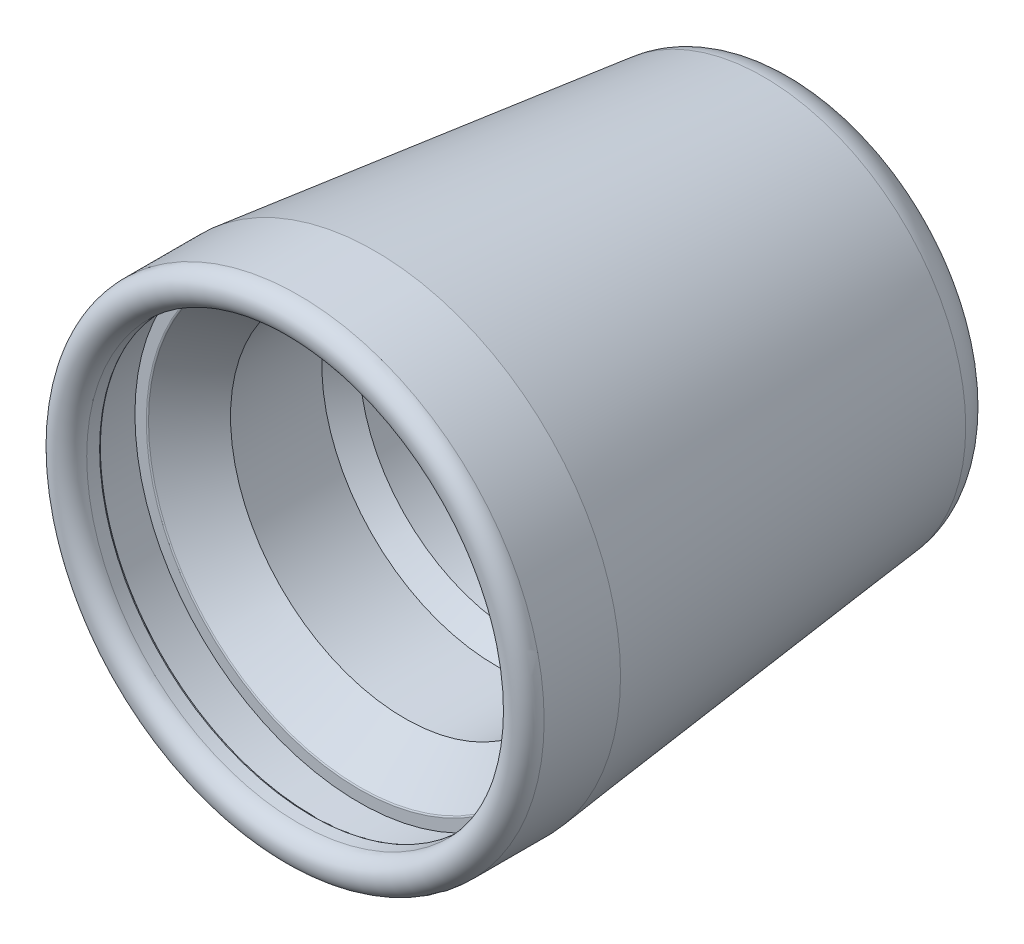
ISO-10303-21;
HEADER;
FILE_DESCRIPTION(('STEP AP214'),'2;1');
FILE_NAME('part.step','',(''),(''),'','','');
FILE_SCHEMA(('AUTOMOTIVE_DESIGN { 1 0 10303 214 1 1 1 1 }'));
ENDSEC;
DATA;
#1=APPLICATION_CONTEXT('core data for automotive mechanical design processes');
#2=APPLICATION_PROTOCOL_DEFINITION('international standard','automotive_design',2000,#1);
#3=PRODUCT_CONTEXT('',#1,'mechanical');
#4=PRODUCT('Part','Part','',(#3));
#5=PRODUCT_RELATED_PRODUCT_CATEGORY('part','',(#4));
#6=PRODUCT_DEFINITION_FORMATION('','',#4);
#7=PRODUCT_DEFINITION_CONTEXT('part definition',#1,'design');
#8=PRODUCT_DEFINITION('design','',#6,#7);
#9=PRODUCT_DEFINITION_SHAPE('','',#8);
#10=(LENGTH_UNIT() NAMED_UNIT(*) SI_UNIT(.MILLI.,.METRE.));
#11=(NAMED_UNIT(*) PLANE_ANGLE_UNIT() SI_UNIT($,.RADIAN.));
#12=(NAMED_UNIT(*) SI_UNIT($,.STERADIAN.) SOLID_ANGLE_UNIT());
#13=UNCERTAINTY_MEASURE_WITH_UNIT(LENGTH_MEASURE(1.E-05),#10,'distance_accuracy_value','');
#14=(GEOMETRIC_REPRESENTATION_CONTEXT(3) GLOBAL_UNCERTAINTY_ASSIGNED_CONTEXT((#13)) GLOBAL_UNIT_ASSIGNED_CONTEXT((#10,
#11,#12)) REPRESENTATION_CONTEXT('',''));
#15=CARTESIAN_POINT('',(0.,0.,0.));
#16=DIRECTION('',(0.,0.,1.));
#17=DIRECTION('',(1.,0.,0.));
#18=AXIS2_PLACEMENT_3D('',#15,#16,#17);
#19=CARTESIAN_POINT('',(0.,0.,3.937));
#20=DIRECTION('',(0.,0.,1.));
#21=DIRECTION('',(1.,0.,0.));
#22=AXIS2_PLACEMENT_3D('',#19,#20,#21);
#23=CYLINDRICAL_SURFACE('',#22,13.5636);
#24=CARTESIAN_POINT('',(0.,0.,4.064));
#25=DIRECTION('',(0.,0.,1.));
#26=DIRECTION('',(1.,0.,0.));
#27=AXIS2_PLACEMENT_3D('',#24,#25,#26);
#28=CIRCLE('',#27,13.5636);
#29=CARTESIAN_POINT('',(13.5636,0.,4.064));
#30=VERTEX_POINT('',#29);
#31=EDGE_CURVE('E62',#30,#30,#28,.F.);
#32=ORIENTED_EDGE('',*,*,#31,.T.);
#33=EDGE_LOOP('',(#32));
#34=FACE_BOUND('',#33,.T.);
#35=CARTESIAN_POINT('',(0.,0.,4.8895));
#36=DIRECTION('',(0.,0.,-1.));
#37=DIRECTION('',(-1.,0.,0.));
#38=AXIS2_PLACEMENT_3D('',#35,#36,#37);
#39=CIRCLE('',#38,13.5636);
#40=CARTESIAN_POINT('',(-13.5636,0.,4.8895));
#41=VERTEX_POINT('',#40);
#42=EDGE_CURVE('E86',#41,#41,#39,.T.);
#43=ORIENTED_EDGE('',*,*,#42,.F.);
#44=EDGE_LOOP('',(#43));
#45=FACE_BOUND('',#44,.T.);
#46=ADVANCED_FACE('F27',(#34,#45),#23,.F.);
#47=CARTESIAN_POINT('',(0.,0.,-27.051));
#48=DIRECTION('',(0.,0.,1.));
#49=DIRECTION('',(1.,0.,0.));
#50=AXIS2_PLACEMENT_3D('',#47,#48,#49);
#51=CYLINDRICAL_SURFACE('',#50,10.1346);
#52=CARTESIAN_POINT('',(0.,0.,-14.478));
#53=DIRECTION('',(0.,0.,-1.));
#54=DIRECTION('',(-1.,0.,0.));
#55=AXIS2_PLACEMENT_3D('',#52,#53,#54);
#56=CIRCLE('',#55,10.1346);
#57=CARTESIAN_POINT('',(-10.1346,0.,-14.478));
#58=VERTEX_POINT('',#57);
#59=EDGE_CURVE('E42',#58,#58,#56,.T.);
#60=ORIENTED_EDGE('',*,*,#59,.T.);
#61=EDGE_LOOP('',(#60));
#62=FACE_BOUND('',#61,.T.);
#63=CARTESIAN_POINT('',(0.,0.,-9.144));
#64=DIRECTION('',(0.,0.,1.));
#65=DIRECTION('',(1.,0.,0.));
#66=AXIS2_PLACEMENT_3D('',#63,#64,#65);
#67=CIRCLE('',#66,10.1346);
#68=CARTESIAN_POINT('',(10.1346,0.,-9.144));
#69=VERTEX_POINT('',#68);
#70=EDGE_CURVE('E83',#69,#69,#67,.T.);
#71=ORIENTED_EDGE('',*,*,#70,.T.);
#72=EDGE_LOOP('',(#71));
#73=FACE_BOUND('',#72,.T.);
#74=ADVANCED_FACE('F104',(#62,#73),#51,.F.);
#75=CARTESIAN_POINT('',(0.,0.,1.016));
#76=DIRECTION('',(0.,0.,1.));
#77=DIRECTION('',(1.,0.,0.));
#78=AXIS2_PLACEMENT_3D('',#75,#76,#77);
#79=PLANE('',#78);
#80=CARTESIAN_POINT('',(0.,0.,1.016));
#81=DIRECTION('',(0.,0.,1.));
#82=DIRECTION('',(1.,0.,0.));
#83=AXIS2_PLACEMENT_3D('',#80,#81,#82);
#84=CIRCLE('',#83,13.6234162699176);
#85=CARTESIAN_POINT('',(13.6234162699176,0.,1.016));
#86=VERTEX_POINT('',#85);
#87=EDGE_CURVE('E53',#86,#86,#84,.F.);
#88=ORIENTED_EDGE('',*,*,#87,.T.);
#89=EDGE_LOOP('',(#88));
#90=FACE_BOUND('',#89,.T.);
#91=CARTESIAN_POINT('',(0.,0.,1.016));
#92=DIRECTION('',(0.,0.,1.));
#93=DIRECTION('',(1.,0.,0.));
#94=AXIS2_PLACEMENT_3D('',#91,#92,#93);
#95=CIRCLE('',#94,14.351);
#96=CARTESIAN_POINT('',(14.351,0.,1.016));
#97=VERTEX_POINT('',#96);
#98=EDGE_CURVE('E71',#97,#97,#95,.T.);
#99=ORIENTED_EDGE('',*,*,#98,.T.);
#100=EDGE_LOOP('',(#99));
#101=FACE_BOUND('',#100,.T.);
#102=ADVANCED_FACE('F110',(#90,#101),#79,.T.);
#103=CARTESIAN_POINT('',(0.,0.,5.969));
#104=DIRECTION('',(0.,0.,-1.));
#105=DIRECTION('',(-1.,0.,0.));
#106=AXIS2_PLACEMENT_3D('',#103,#104,#105);
#107=CYLINDRICAL_SURFACE('',#106,15.7226);
#108=CARTESIAN_POINT('',(0.,0.,4.8895));
#109=DIRECTION('',(0.,0.,-1.));
#110=DIRECTION('',(-1.,0.,0.));
#111=AXIS2_PLACEMENT_3D('',#108,#109,#110);
#112=CIRCLE('',#111,15.7226);
#113=CARTESIAN_POINT('',(-15.7226,0.,4.8895));
#114=VERTEX_POINT('',#113);
#115=EDGE_CURVE('E89',#114,#114,#112,.T.);
#116=ORIENTED_EDGE('',*,*,#115,.T.);
#117=EDGE_LOOP('',(#116));
#118=FACE_BOUND('',#117,.T.);
#119=CARTESIAN_POINT('',(0.,0.,0.));
#120=DIRECTION('',(0.,0.,-1.));
#121=DIRECTION('',(-1.,0.,0.));
#122=AXIS2_PLACEMENT_3D('',#119,#120,#121);
#123=CIRCLE('',#122,15.7226);
#124=CARTESIAN_POINT('',(-15.7226,0.,0.));
#125=VERTEX_POINT('',#124);
#126=EDGE_CURVE('E68',#125,#125,#123,.T.);
#127=ORIENTED_EDGE('',*,*,#126,.F.);
#128=EDGE_LOOP('',(#127));
#129=FACE_BOUND('',#128,.T.);
#130=ADVANCED_FACE('F29',(#118,#129),#107,.T.);
#131=CARTESIAN_POINT('',(0.,0.,-27.051));
#132=DIRECTION('',(0.,0.,1.));
#133=DIRECTION('',(1.,0.,0.));
#134=AXIS2_PLACEMENT_3D('',#131,#132,#133);
#135=CONICAL_SURFACE('',#134,12.7,0.111275522826349);
#136=CARTESIAN_POINT('',(0.,0.,-24.8792369988799));
#137=DIRECTION('',(0.,0.,1.));
#138=DIRECTION('',(1.,0.,0.));
#139=AXIS2_PLACEMENT_3D('',#136,#137,#138);
#140=CIRCLE('',#139,12.9426664761815);
#141=CARTESIAN_POINT('',(12.9426664761815,0.,-24.8792369988799));
#142=VERTEX_POINT('',#141);
#143=EDGE_CURVE('E65',#142,#142,#140,.T.);
#144=ORIENTED_EDGE('',*,*,#143,.T.);
#145=EDGE_LOOP('',(#144));
#146=FACE_BOUND('',#145,.T.);
#147=ORIENTED_EDGE('',*,*,#126,.T.);
#148=EDGE_LOOP('',(#147));
#149=FACE_BOUND('',#148,.T.);
#150=ADVANCED_FACE('F116',(#146,#149),#135,.T.);
#151=CARTESIAN_POINT('',(0.,0.,3.937));
#152=DIRECTION('',(0.,0.,1.));
#153=DIRECTION('',(1.,0.,0.));
#154=AXIS2_PLACEMENT_3D('',#151,#152,#153);
#155=PLANE('',#154);
#156=CARTESIAN_POINT('',(0.,0.,3.937));
#157=DIRECTION('',(0.,0.,1.));
#158=DIRECTION('',(1.,0.,0.));
#159=AXIS2_PLACEMENT_3D('',#156,#157,#158);
#160=CIRCLE('',#159,13.6906);
#161=CARTESIAN_POINT('',(13.6906,0.,3.937));
#162=VERTEX_POINT('',#161);
#163=EDGE_CURVE('E59',#162,#162,#160,.T.);
#164=ORIENTED_EDGE('',*,*,#163,.T.);
#165=EDGE_LOOP('',(#164));
#166=FACE_BOUND('',#165,.T.);
#167=CARTESIAN_POINT('',(0.,0.,3.937));
#168=DIRECTION('',(0.,0.,1.));
#169=DIRECTION('',(1.,0.,0.));
#170=AXIS2_PLACEMENT_3D('',#167,#168,#169);
#171=CIRCLE('',#170,14.351);
#172=CARTESIAN_POINT('',(14.351,0.,3.937));
#173=VERTEX_POINT('',#172);
#174=EDGE_CURVE('E74',#173,#173,#171,.T.);
#175=ORIENTED_EDGE('',*,*,#174,.F.);
#176=EDGE_LOOP('',(#175));
#177=FACE_BOUND('',#176,.T.);
#178=ADVANCED_FACE('F118',(#166,#177),#155,.F.);
#179=CARTESIAN_POINT('',(0.,0.,1.016));
#180=DIRECTION('',(0.,0.,1.));
#181=DIRECTION('',(1.,0.,0.));
#182=AXIS2_PLACEMENT_3D('',#179,#180,#181);
#183=CYLINDRICAL_SURFACE('',#182,14.351);
#184=ORIENTED_EDGE('',*,*,#98,.F.);
#185=EDGE_LOOP('',(#184));
#186=FACE_BOUND('',#185,.T.);
#187=ORIENTED_EDGE('',*,*,#174,.T.);
#188=EDGE_LOOP('',(#187));
#189=FACE_BOUND('',#188,.T.);
#190=ADVANCED_FACE('F114',(#186,#189),#183,.F.);
#191=CARTESIAN_POINT('',(0.,0.,-1.905));
#192=DIRECTION('',(0.,0.,1.));
#193=DIRECTION('',(1.,0.,0.));
#194=AXIS2_PLACEMENT_3D('',#191,#192,#193);
#195=CONICAL_SURFACE('',#194,11.1506,0.690446457054692);
#196=CARTESIAN_POINT('',(0.,0.,0.969883943768525));
#197=DIRECTION('',(0.,0.,-1.));
#198=DIRECTION('',(-1.,0.,0.));
#199=AXIS2_PLACEMENT_3D('',#196,#197,#198);
#200=CIRCLE('',#199,13.525504127461);
#201=CARTESIAN_POINT('',(-13.525504127461,0.,0.969883943768525));
#202=VERTEX_POINT('',#201);
#203=EDGE_CURVE('E56',#202,#202,#200,.F.);
#204=ORIENTED_EDGE('',*,*,#203,.T.);
#205=EDGE_LOOP('',(#204));
#206=FACE_BOUND('',#205,.T.);
#207=CARTESIAN_POINT('',(0.,0.,-1.905));
#208=DIRECTION('',(0.,0.,1.));
#209=DIRECTION('',(1.,0.,0.));
#210=AXIS2_PLACEMENT_3D('',#207,#208,#209);
#211=CIRCLE('',#210,11.1506);
#212=CARTESIAN_POINT('',(11.1506,0.,-1.905));
#213=VERTEX_POINT('',#212);
#214=EDGE_CURVE('E77',#213,#213,#211,.T.);
#215=ORIENTED_EDGE('',*,*,#214,.F.);
#216=EDGE_LOOP('',(#215));
#217=FACE_BOUND('',#216,.T.);
#218=ADVANCED_FACE('F151',(#206,#217),#195,.F.);
#219=CARTESIAN_POINT('',(0.,0.,-7.747));
#220=DIRECTION('',(0.,0.,1.));
#221=DIRECTION('',(1.,0.,0.));
#222=AXIS2_PLACEMENT_3D('',#219,#220,#221);
#223=CYLINDRICAL_SURFACE('',#222,11.1506);
#224=CARTESIAN_POINT('',(0.,0.,-7.747));
#225=DIRECTION('',(0.,0.,1.));
#226=DIRECTION('',(1.,0.,0.));
#227=AXIS2_PLACEMENT_3D('',#224,#225,#226);
#228=CIRCLE('',#227,11.1506);
#229=CARTESIAN_POINT('',(11.1506,0.,-7.747));
#230=VERTEX_POINT('',#229);
#231=EDGE_CURVE('E80',#230,#230,#228,.T.);
#232=ORIENTED_EDGE('',*,*,#231,.F.);
#233=EDGE_LOOP('',(#232));
#234=FACE_BOUND('',#233,.T.);
#235=ORIENTED_EDGE('',*,*,#214,.T.);
#236=EDGE_LOOP('',(#235));
#237=FACE_BOUND('',#236,.T.);
#238=ADVANCED_FACE('F147',(#234,#237),#223,.F.);
#239=CARTESIAN_POINT('',(0.,0.,-9.144));
#240=DIRECTION('',(0.,0.,1.));
#241=DIRECTION('',(1.,0.,0.));
#242=AXIS2_PLACEMENT_3D('',#239,#240,#241);
#243=CONICAL_SURFACE('',#242,10.1346,0.628796286415433);
#244=ORIENTED_EDGE('',*,*,#231,.T.);
#245=EDGE_LOOP('',(#244));
#246=FACE_BOUND('',#245,.T.);
#247=ORIENTED_EDGE('',*,*,#70,.F.);
#248=EDGE_LOOP('',(#247));
#249=FACE_BOUND('',#248,.T.);
#250=ADVANCED_FACE('F143',(#246,#249),#243,.F.);
#251=CARTESIAN_POINT('',(0.,0.,-14.605));
#252=DIRECTION('',(0.,0.,-1.));
#253=DIRECTION('',(-1.,0.,0.));
#254=AXIS2_PLACEMENT_3D('',#251,#252,#253);
#255=PLANE('',#254);
#256=CARTESIAN_POINT('',(0.,0.,-14.605));
#257=DIRECTION('',(0.,0.,-1.));
#258=DIRECTION('',(-1.,0.,0.));
#259=AXIS2_PLACEMENT_3D('',#256,#257,#258);
#260=CIRCLE('',#259,10.2616);
#261=CARTESIAN_POINT('',(-10.2616,0.,-14.605));
#262=VERTEX_POINT('',#261);
#263=EDGE_CURVE('E47',#262,#262,#260,.F.);
#264=ORIENTED_EDGE('',*,*,#263,.T.);
#265=EDGE_LOOP('',(#264));
#266=FACE_BOUND('',#265,.T.);
#267=CARTESIAN_POINT('',(0.,0.,-14.605));
#268=DIRECTION('',(0.,0.,-1.));
#269=DIRECTION('',(-1.,0.,0.));
#270=AXIS2_PLACEMENT_3D('',#267,#268,#269);
#271=CIRCLE('',#270,10.9474);
#272=CARTESIAN_POINT('',(-10.9474,0.,-14.605));
#273=VERTEX_POINT('',#272);
#274=EDGE_CURVE('E50',#273,#273,#271,.T.);
#275=ORIENTED_EDGE('',*,*,#274,.T.);
#276=EDGE_LOOP('',(#275));
#277=FACE_BOUND('',#276,.T.);
#278=ADVANCED_FACE('F138',(#266,#277),#255,.T.);
#279=CARTESIAN_POINT('',(0.,0.,-14.605));
#280=DIRECTION('',(0.,0.,-1.));
#281=DIRECTION('',(-1.,0.,0.));
#282=AXIS2_PLACEMENT_3D('',#279,#280,#281);
#283=CYLINDRICAL_SURFACE('',#282,11.0744);
#284=CARTESIAN_POINT('',(0.,0.,-26.7398139927239));
#285=DIRECTION('',(0.,0.,-1.));
#286=DIRECTION('',(-1.,0.,0.));
#287=AXIS2_PLACEMENT_3D('',#284,#285,#286);
#288=CIRCLE('',#287,11.0744);
#289=CARTESIAN_POINT('',(-11.0744,0.,-26.7398139927239));
#290=VERTEX_POINT('',#289);
#291=EDGE_CURVE('E34',#290,#290,#288,.T.);
#292=ORIENTED_EDGE('',*,*,#291,.T.);
#293=EDGE_LOOP('',(#292));
#294=FACE_BOUND('',#293,.T.);
#295=CARTESIAN_POINT('',(0.,0.,-14.732));
#296=DIRECTION('',(0.,0.,-1.));
#297=DIRECTION('',(-1.,0.,0.));
#298=AXIS2_PLACEMENT_3D('',#295,#296,#297);
#299=CIRCLE('',#298,11.0744);
#300=CARTESIAN_POINT('',(-11.0744,0.,-14.732));
#301=VERTEX_POINT('',#300);
#302=EDGE_CURVE('E38',#301,#301,#299,.F.);
#303=ORIENTED_EDGE('',*,*,#302,.T.);
#304=EDGE_LOOP('',(#303));
#305=FACE_BOUND('',#304,.T.);
#306=ADVANCED_FACE('F132',(#294,#305),#283,.F.);
#307=CARTESIAN_POINT('',(0.,0.,-24.5971800956787));
#308=DIRECTION('',(0.,0.,-1.));
#309=DIRECTION('',(-1.,0.,0.));
#310=AXIS2_PLACEMENT_3D('',#307,#308,#309);
#311=TOROIDAL_SURFACE('',#310,10.4183757038344,2.54);
#312=CARTESIAN_POINT('',(0.,0.,-26.9348570169005));
#313=DIRECTION('',(0.,0.,1.));
#314=DIRECTION('',(1.,0.,0.));
#315=AXIS2_PLACEMENT_3D('',#312,#313,#314);
#316=CIRCLE('',#315,11.4117873063373);
#317=CARTESIAN_POINT('',(11.4117873063373,0.,-26.9348570169005));
#318=VERTEX_POINT('',#317);
#319=EDGE_CURVE('E10',#318,#318,#316,.T.);
#320=ORIENTED_EDGE('',*,*,#319,.T.);
#321=EDGE_LOOP('',(#320));
#322=FACE_BOUND('',#321,.T.);
#323=ORIENTED_EDGE('',*,*,#143,.F.);
#324=EDGE_LOOP('',(#323));
#325=FACE_BOUND('',#324,.T.);
#326=ADVANCED_FACE('F99',(#322,#325),#311,.T.);
#327=CARTESIAN_POINT('',(0.,0.,4.8895));
#328=DIRECTION('',(0.,0.,-1.));
#329=DIRECTION('',(-1.,0.,0.));
#330=AXIS2_PLACEMENT_3D('',#327,#328,#329);
#331=TOROIDAL_SURFACE('',#330,14.6431,1.0795);
#332=ORIENTED_EDGE('',*,*,#115,.F.);
#333=EDGE_LOOP('',(#332));
#334=FACE_BOUND('',#333,.T.);
#335=ORIENTED_EDGE('',*,*,#42,.T.);
#336=EDGE_LOOP('',(#335));
#337=FACE_BOUND('',#336,.T.);
#338=ADVANCED_FACE('F95',(#334,#337),#331,.T.);
#339=CARTESIAN_POINT('',(0.,0.,4.064));
#340=DIRECTION('',(0.,0.,1.));
#341=DIRECTION('',(1.,0.,0.));
#342=AXIS2_PLACEMENT_3D('',#339,#340,#341);
#343=TOROIDAL_SURFACE('',#342,13.6906,0.127);
#344=ORIENTED_EDGE('',*,*,#163,.F.);
#345=EDGE_LOOP('',(#344));
#346=FACE_BOUND('',#345,.T.);
#347=ORIENTED_EDGE('',*,*,#31,.F.);
#348=EDGE_LOOP('',(#347));
#349=FACE_BOUND('',#348,.T.);
#350=ADVANCED_FACE('F98',(#346,#349),#343,.T.);
#351=CARTESIAN_POINT('',(0.,0.,0.889));
#352=DIRECTION('',(0.,0.,1.));
#353=DIRECTION('',(1.,0.,0.));
#354=AXIS2_PLACEMENT_3D('',#351,#352,#353);
#355=TOROIDAL_SURFACE('',#354,13.6234162699176,0.127);
#356=ORIENTED_EDGE('',*,*,#87,.F.);
#357=EDGE_LOOP('',(#356));
#358=FACE_BOUND('',#357,.T.);
#359=ORIENTED_EDGE('',*,*,#203,.F.);
#360=EDGE_LOOP('',(#359));
#361=FACE_BOUND('',#360,.T.);
#362=ADVANCED_FACE('F207',(#358,#361),#355,.T.);
#363=CARTESIAN_POINT('',(0.,0.,-14.478));
#364=DIRECTION('',(0.,0.,-1.));
#365=DIRECTION('',(-1.,0.,0.));
#366=AXIS2_PLACEMENT_3D('',#363,#364,#365);
#367=TOROIDAL_SURFACE('',#366,10.2616,0.127);
#368=ORIENTED_EDGE('',*,*,#59,.F.);
#369=EDGE_LOOP('',(#368));
#370=FACE_BOUND('',#369,.T.);
#371=ORIENTED_EDGE('',*,*,#263,.F.);
#372=EDGE_LOOP('',(#371));
#373=FACE_BOUND('',#372,.T.);
#374=ADVANCED_FACE('F214',(#370,#373),#367,.T.);
#375=CARTESIAN_POINT('',(0.,0.,-14.732));
#376=DIRECTION('',(0.,0.,-1.));
#377=DIRECTION('',(-1.,0.,0.));
#378=AXIS2_PLACEMENT_3D('',#375,#376,#377);
#379=TOROIDAL_SURFACE('',#378,10.9474,0.127);
#380=ORIENTED_EDGE('',*,*,#302,.F.);
#381=EDGE_LOOP('',(#380));
#382=FACE_BOUND('',#381,.T.);
#383=ORIENTED_EDGE('',*,*,#274,.F.);
#384=EDGE_LOOP('',(#383));
#385=FACE_BOUND('',#384,.T.);
#386=ADVANCED_FACE('F222',(#382,#385),#379,.F.);
#387=CARTESIAN_POINT('',(0.,0.,-26.7398139927239));
#388=DIRECTION('',(0.,0.,-1.));
#389=DIRECTION('',(-1.,0.,0.));
#390=AXIS2_PLACEMENT_3D('',#387,#388,#389);
#391=CONICAL_SURFACE('',#390,11.0744,1.04663671882446);
#392=ORIENTED_EDGE('',*,*,#319,.F.);
#393=EDGE_LOOP('',(#392));
#394=FACE_BOUND('',#393,.T.);
#395=ORIENTED_EDGE('',*,*,#291,.F.);
#396=EDGE_LOOP('',(#395));
#397=FACE_BOUND('',#396,.T.);
#398=ADVANCED_FACE('F229',(#394,#397),#391,.F.);
#399=CLOSED_SHELL('',(#46,#74,#102,#130,#150,#178,#190,#218,#238,#250,#278,#306,#326,#338,#350,
#362,#374,#386,#398));
#400=MANIFOLD_SOLID_BREP('B2',#399);
#401=ADVANCED_BREP_SHAPE_REPRESENTATION('',(#18,#400),#14);
#402=SHAPE_DEFINITION_REPRESENTATION(#9,#401);
ENDSEC;
END-ISO-10303-21;
